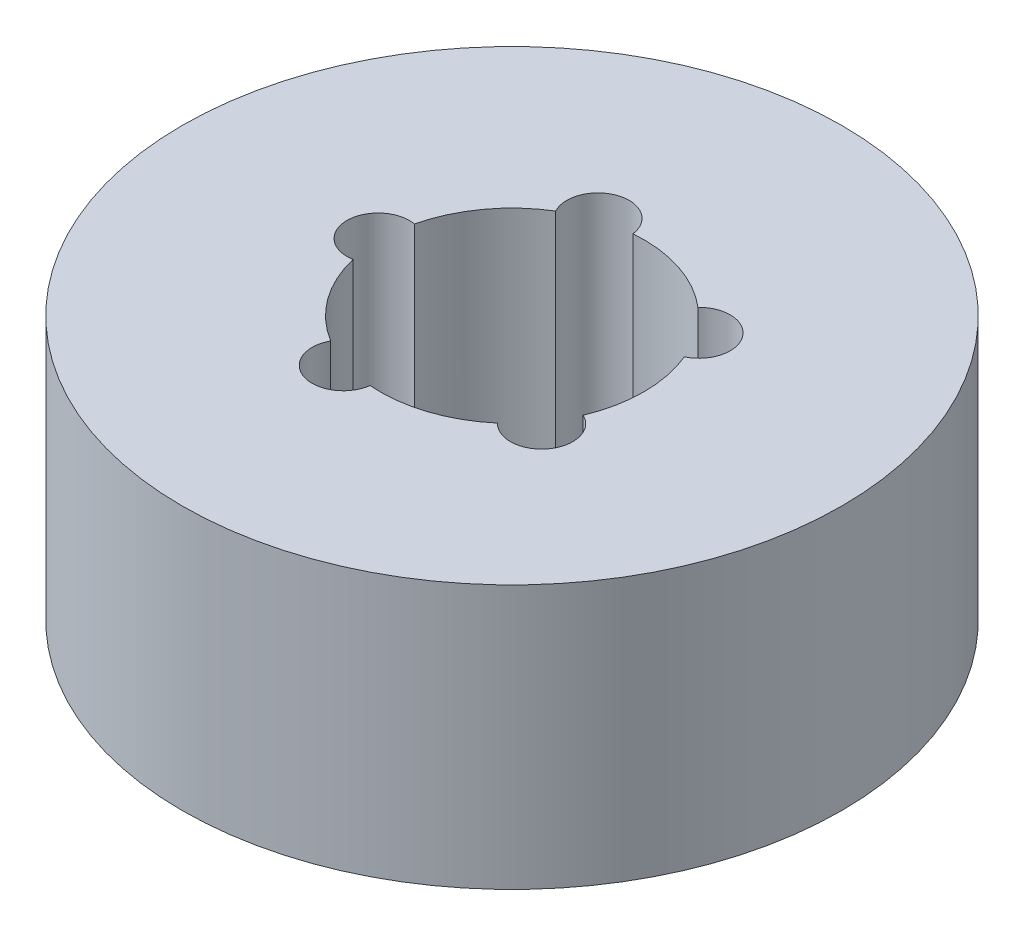
ISO-10303-21;
HEADER;
FILE_DESCRIPTION(('STEP AP214'),'2;1');
FILE_NAME('part.step','',(''),(''),'','','');
FILE_SCHEMA(('AUTOMOTIVE_DESIGN { 1 0 10303 214 1 1 1 1 }'));
ENDSEC;
DATA;
#1=APPLICATION_CONTEXT('core data for automotive mechanical design processes');
#2=APPLICATION_PROTOCOL_DEFINITION('international standard','automotive_design',2000,#1);
#3=PRODUCT_CONTEXT('',#1,'mechanical');
#4=PRODUCT('Part','Part','',(#3));
#5=PRODUCT_RELATED_PRODUCT_CATEGORY('part','',(#4));
#6=PRODUCT_DEFINITION_FORMATION('','',#4);
#7=PRODUCT_DEFINITION_CONTEXT('part definition',#1,'design');
#8=PRODUCT_DEFINITION('design','',#6,#7);
#9=PRODUCT_DEFINITION_SHAPE('','',#8);
#10=(LENGTH_UNIT() NAMED_UNIT(*) SI_UNIT(.MILLI.,.METRE.));
#11=(NAMED_UNIT(*) PLANE_ANGLE_UNIT() SI_UNIT($,.RADIAN.));
#12=(NAMED_UNIT(*) SI_UNIT($,.STERADIAN.) SOLID_ANGLE_UNIT());
#13=UNCERTAINTY_MEASURE_WITH_UNIT(LENGTH_MEASURE(1.E-05),#10,'distance_accuracy_value','');
#14=(GEOMETRIC_REPRESENTATION_CONTEXT(3) GLOBAL_UNCERTAINTY_ASSIGNED_CONTEXT((#13)) GLOBAL_UNIT_ASSIGNED_CONTEXT((#10,
#11,#12)) REPRESENTATION_CONTEXT('',''));
#15=CARTESIAN_POINT('',(0.,0.,0.));
#16=DIRECTION('',(0.,0.,1.));
#17=DIRECTION('',(1.,0.,0.));
#18=AXIS2_PLACEMENT_3D('',#15,#16,#17);
#19=CARTESIAN_POINT('',(0.,20.,0.));
#20=DIRECTION('',(0.,-1.,0.));
#21=DIRECTION('',(0.,0.,-1.));
#22=AXIS2_PLACEMENT_3D('',#19,#20,#21);
#23=CYLINDRICAL_SURFACE('',#22,25.);
#24=CARTESIAN_POINT('',(0.,20.,0.));
#25=DIRECTION('',(0.,1.,0.));
#26=DIRECTION('',(0.,0.,1.));
#27=AXIS2_PLACEMENT_3D('',#24,#25,#26);
#28=CIRCLE('',#27,25.);
#29=CARTESIAN_POINT('',(0.,20.,25.));
#30=VERTEX_POINT('',#29);
#31=EDGE_CURVE('E157',#30,#30,#28,.T.);
#32=ORIENTED_EDGE('',*,*,#31,.F.);
#33=EDGE_LOOP('',(#32));
#34=FACE_BOUND('',#33,.T.);
#35=CARTESIAN_POINT('',(0.,0.,0.));
#36=DIRECTION('',(0.,1.,0.));
#37=DIRECTION('',(0.,0.,1.));
#38=AXIS2_PLACEMENT_3D('',#35,#36,#37);
#39=CIRCLE('',#38,25.);
#40=CARTESIAN_POINT('',(0.,0.,25.));
#41=VERTEX_POINT('',#40);
#42=EDGE_CURVE('E150',#41,#41,#39,.T.);
#43=ORIENTED_EDGE('',*,*,#42,.T.);
#44=EDGE_LOOP('',(#43));
#45=FACE_BOUND('',#44,.T.);
#46=ADVANCED_FACE('F39',(#34,#45),#23,.T.);
#47=CARTESIAN_POINT('',(0.,20.,0.));
#48=DIRECTION('',(0.,1.,0.));
#49=DIRECTION('',(0.,0.,1.));
#50=AXIS2_PLACEMENT_3D('',#47,#48,#49);
#51=PLANE('',#50);
#52=CARTESIAN_POINT('',(-3.13641584657563,20.,-9.65289541674102));
#53=DIRECTION('',(0.,1.,0.));
#54=DIRECTION('',(-0.95105651629515,0.,0.309016994374958));
#55=AXIS2_PLACEMENT_3D('',#52,#53,#54);
#56=CIRCLE('',#55,2.3653306367673);
#57=CARTESIAN_POINT('',(-0.792244390742548,20.,-9.9685680428704));
#58=VERTEX_POINT('',#57);
#59=CARTESIAN_POINT('',(-5.21843810626451,20.,-8.53041052535495));
#60=VERTEX_POINT('',#59);
#61=EDGE_CURVE('E194',#58,#60,#56,.T.);
#62=ORIENTED_EDGE('',*,*,#61,.F.);
#63=CARTESIAN_POINT('',(0.,20.,0.));
#64=DIRECTION('',(0.,1.,0.));
#65=DIRECTION('',(0.,0.,1.));
#66=AXIS2_PLACEMENT_3D('',#63,#64,#65);
#67=CIRCLE('',#66,10.);
#68=CARTESIAN_POINT('',(6.50031645788205,20.,-7.59907138717539));
#69=VERTEX_POINT('',#68);
#70=EDGE_CURVE('E147',#69,#58,#67,.T.);
#71=ORIENTED_EDGE('',*,*,#70,.F.);
#72=CARTESIAN_POINT('',(8.21124328918843,20.,-5.96581745739413));
#73=DIRECTION('',(0.,1.,0.));
#74=DIRECTION('',(-0.58778525229248,0.,-0.809016994374942));
#75=AXIS2_PLACEMENT_3D('',#72,#73,#74);
#76=CIRCLE('',#75,2.3653306367673);
#77=CARTESIAN_POINT('',(9.23585461486585,20.,-3.83392612514392));
#78=VERTEX_POINT('',#77);
#79=EDGE_CURVE('E254',#78,#69,#76,.T.);
#80=ORIENTED_EDGE('',*,*,#79,.F.);
#81=CARTESIAN_POINT('',(9.23585461486591,20.,3.83392612514379));
#82=VERTEX_POINT('',#81);
#83=EDGE_CURVE('E144',#82,#78,#67,.T.);
#84=ORIENTED_EDGE('',*,*,#83,.F.);
#85=CARTESIAN_POINT('',(8.21124328918852,20.,5.96581745739401));
#86=DIRECTION('',(0.,1.,0.));
#87=DIRECTION('',(0.587785252292469,0.,-0.809016994374951));
#88=AXIS2_PLACEMENT_3D('',#85,#86,#87);
#89=CIRCLE('',#88,2.3653306367673);
#90=CARTESIAN_POINT('',(6.50031645788216,20.,7.59907138717529));
#91=VERTEX_POINT('',#90);
#92=EDGE_CURVE('E141',#91,#82,#89,.T.);
#93=ORIENTED_EDGE('',*,*,#92,.F.);
#94=CARTESIAN_POINT('',(-0.792244390742406,20.,9.96856804287041));
#95=VERTEX_POINT('',#94);
#96=EDGE_CURVE('E134',#95,#91,#67,.T.);
#97=ORIENTED_EDGE('',*,*,#96,.F.);
#98=CARTESIAN_POINT('',(-3.13641584657549,20.,9.65289541674107));
#99=DIRECTION('',(0.,1.,0.));
#100=DIRECTION('',(0.951056516295155,0.,0.309016994374945));
#101=AXIS2_PLACEMENT_3D('',#98,#99,#100);
#102=CIRCLE('',#101,2.3653306367673);
#103=CARTESIAN_POINT('',(-5.21843810626439,20.,8.53041052535502));
#104=VERTEX_POINT('',#103);
#105=EDGE_CURVE('E111',#104,#95,#102,.T.);
#106=ORIENTED_EDGE('',*,*,#105,.F.);
#107=CARTESIAN_POINT('',(-9.72548857574117,20.,2.32698774451609));
#108=VERTEX_POINT('',#107);
#109=EDGE_CURVE('E145',#108,#104,#67,.T.);
#110=ORIENTED_EDGE('',*,*,#109,.F.);
#111=CARTESIAN_POINT('',(-10.1496548852259,20.,0.));
#112=DIRECTION('',(0.,1.,0.));
#113=DIRECTION('',(0.,0.,1.));
#114=AXIS2_PLACEMENT_3D('',#111,#112,#113);
#115=CIRCLE('',#114,2.3653306367673);
#116=CARTESIAN_POINT('',(-9.72548857574117,20.,-2.32698774451609));
#117=VERTEX_POINT('',#116);
#118=EDGE_CURVE('E153',#117,#108,#115,.T.);
#119=ORIENTED_EDGE('',*,*,#118,.F.);
#120=EDGE_CURVE('E146',#60,#117,#67,.T.);
#121=ORIENTED_EDGE('',*,*,#120,.F.);
#122=EDGE_LOOP('',(#62,#71,#80,#84,#93,#97,#106,#110,#119,#121));
#123=FACE_BOUND('',#122,.T.);
#124=ORIENTED_EDGE('',*,*,#31,.T.);
#125=EDGE_LOOP('',(#124));
#126=FACE_BOUND('',#125,.T.);
#127=ADVANCED_FACE('F139',(#123,#126),#51,.T.);
#128=CARTESIAN_POINT('',(0.,0.,0.));
#129=DIRECTION('',(0.,1.,0.));
#130=DIRECTION('',(0.,0.,1.));
#131=AXIS2_PLACEMENT_3D('',#128,#129,#130);
#132=PLANE('',#131);
#133=CARTESIAN_POINT('',(0.,0.,0.));
#134=DIRECTION('',(0.,1.,0.));
#135=DIRECTION('',(0.,0.,1.));
#136=AXIS2_PLACEMENT_3D('',#133,#134,#135);
#137=CIRCLE('',#136,10.);
#138=CARTESIAN_POINT('',(0.,0.,10.));
#139=VERTEX_POINT('',#138);
#140=EDGE_CURVE('E154',#139,#139,#137,.T.);
#141=ORIENTED_EDGE('',*,*,#140,.T.);
#142=EDGE_LOOP('',(#141));
#143=FACE_BOUND('',#142,.T.);
#144=ORIENTED_EDGE('',*,*,#42,.F.);
#145=EDGE_LOOP('',(#144));
#146=FACE_BOUND('',#145,.T.);
#147=ADVANCED_FACE('F213',(#143,#146),#132,.F.);
#148=CARTESIAN_POINT('',(0.,20.,0.));
#149=DIRECTION('',(0.,-1.,0.));
#150=DIRECTION('',(0.,0.,-1.));
#151=AXIS2_PLACEMENT_3D('',#148,#149,#150);
#152=CYLINDRICAL_SURFACE('',#151,10.);
#153=DIRECTION('',(0.,1.,0.));
#154=VECTOR('',#153,1.);
#155=CARTESIAN_POINT('',(-0.792244390742548,11.6413522933733,-9.9685680428704));
#156=LINE('',#155,#154);
#157=CARTESIAN_POINT('',(-0.792244390742548,3.28270458674656,-9.9685680428704));
#158=VERTEX_POINT('',#157);
#159=EDGE_CURVE('E11',#158,#58,#156,.T.);
#160=ORIENTED_EDGE('',*,*,#159,.F.);
#161=CARTESIAN_POINT('',(0.,3.28270458674656,0.));
#162=DIRECTION('',(0.,1.,0.));
#163=DIRECTION('',(0.,0.,1.));
#164=AXIS2_PLACEMENT_3D('',#161,#162,#163);
#165=CIRCLE('',#164,10.);
#166=CARTESIAN_POINT('',(-5.21843810626451,3.28270458674656,-8.53041052535495));
#167=VERTEX_POINT('',#166);
#168=EDGE_CURVE('E189',#158,#167,#165,.T.);
#169=ORIENTED_EDGE('',*,*,#168,.T.);
#170=DIRECTION('',(0.,1.,0.));
#171=VECTOR('',#170,1.);
#172=CARTESIAN_POINT('',(-5.21843810626451,11.6413522933733,-8.53041052535495));
#173=LINE('',#172,#171);
#174=EDGE_CURVE('E46',#60,#167,#173,.F.);
#175=ORIENTED_EDGE('',*,*,#174,.F.);
#176=ORIENTED_EDGE('',*,*,#120,.T.);
#177=DIRECTION('',(0.,1.,0.));
#178=VECTOR('',#177,1.);
#179=CARTESIAN_POINT('',(-9.72548857574117,11.6413522933733,-2.32698774451609));
#180=LINE('',#179,#178);
#181=CARTESIAN_POINT('',(-9.72548857574117,3.28270458674656,-2.32698774451609));
#182=VERTEX_POINT('',#181);
#183=EDGE_CURVE('E168',#182,#117,#180,.T.);
#184=ORIENTED_EDGE('',*,*,#183,.F.);
#185=CARTESIAN_POINT('',(0.,3.28270458674656,0.));
#186=DIRECTION('',(0.,1.,0.));
#187=DIRECTION('',(0.,0.,1.));
#188=AXIS2_PLACEMENT_3D('',#185,#186,#187);
#189=CIRCLE('',#188,10.);
#190=CARTESIAN_POINT('',(-9.72548857574117,3.28270458674656,2.32698774451609));
#191=VERTEX_POINT('',#190);
#192=EDGE_CURVE('E165',#182,#191,#189,.T.);
#193=ORIENTED_EDGE('',*,*,#192,.T.);
#194=DIRECTION('',(0.,1.,0.));
#195=VECTOR('',#194,1.);
#196=CARTESIAN_POINT('',(-9.72548857574117,11.6413522933733,2.32698774451609));
#197=LINE('',#196,#195);
#198=EDGE_CURVE('E170',#108,#191,#197,.F.);
#199=ORIENTED_EDGE('',*,*,#198,.F.);
#200=ORIENTED_EDGE('',*,*,#109,.T.);
#201=DIRECTION('',(0.,1.,0.));
#202=VECTOR('',#201,1.);
#203=CARTESIAN_POINT('',(-5.21843810626439,11.6413522933733,8.53041052535502));
#204=LINE('',#203,#202);
#205=CARTESIAN_POINT('',(-5.21843810626439,3.28270458674656,8.53041052535502));
#206=VERTEX_POINT('',#205);
#207=EDGE_CURVE('E121',#206,#104,#204,.T.);
#208=ORIENTED_EDGE('',*,*,#207,.F.);
#209=CARTESIAN_POINT('',(0.,3.28270458674656,0.));
#210=DIRECTION('',(0.,1.,0.));
#211=DIRECTION('',(0.,0.,1.));
#212=AXIS2_PLACEMENT_3D('',#209,#210,#211);
#213=CIRCLE('',#212,10.);
#214=CARTESIAN_POINT('',(-0.792244390742406,3.28270458674656,9.96856804287041));
#215=VERTEX_POINT('',#214);
#216=EDGE_CURVE('E136',#206,#215,#213,.T.);
#217=ORIENTED_EDGE('',*,*,#216,.T.);
#218=DIRECTION('',(0.,1.,0.));
#219=VECTOR('',#218,1.);
#220=CARTESIAN_POINT('',(-0.792244390742406,11.6413522933733,9.96856804287041));
#221=LINE('',#220,#219);
#222=EDGE_CURVE('E117',#95,#215,#221,.F.);
#223=ORIENTED_EDGE('',*,*,#222,.F.);
#224=ORIENTED_EDGE('',*,*,#96,.T.);
#225=DIRECTION('',(0.,1.,0.));
#226=VECTOR('',#225,1.);
#227=CARTESIAN_POINT('',(6.50031645788217,11.6413522933733,7.59907138717529));
#228=LINE('',#227,#226);
#229=CARTESIAN_POINT('',(6.50031645788216,3.28270458674656,7.59907138717529));
#230=VERTEX_POINT('',#229);
#231=EDGE_CURVE('E182',#230,#91,#228,.T.);
#232=ORIENTED_EDGE('',*,*,#231,.F.);
#233=CARTESIAN_POINT('',(0.,3.28270458674656,0.));
#234=DIRECTION('',(0.,1.,0.));
#235=DIRECTION('',(0.,0.,1.));
#236=AXIS2_PLACEMENT_3D('',#233,#234,#235);
#237=CIRCLE('',#236,10.);
#238=CARTESIAN_POINT('',(9.23585461486591,3.28270458674656,3.83392612514379));
#239=VERTEX_POINT('',#238);
#240=EDGE_CURVE('E174',#230,#239,#237,.T.);
#241=ORIENTED_EDGE('',*,*,#240,.T.);
#242=DIRECTION('',(0.,1.,0.));
#243=VECTOR('',#242,1.);
#244=CARTESIAN_POINT('',(9.23585461486591,11.6413522933733,3.83392612514379));
#245=LINE('',#244,#243);
#246=EDGE_CURVE('E177',#82,#239,#245,.F.);
#247=ORIENTED_EDGE('',*,*,#246,.F.);
#248=ORIENTED_EDGE('',*,*,#83,.T.);
#249=DIRECTION('',(0.,1.,0.));
#250=VECTOR('',#249,1.);
#251=CARTESIAN_POINT('',(9.23585461486585,11.6413522933733,-3.83392612514392));
#252=LINE('',#251,#250);
#253=CARTESIAN_POINT('',(9.23585461486585,3.28270458674656,-3.83392612514392));
#254=VERTEX_POINT('',#253);
#255=EDGE_CURVE('E187',#254,#78,#252,.T.);
#256=ORIENTED_EDGE('',*,*,#255,.F.);
#257=CARTESIAN_POINT('',(0.,3.28270458674656,0.));
#258=DIRECTION('',(0.,1.,0.));
#259=DIRECTION('',(0.,0.,1.));
#260=AXIS2_PLACEMENT_3D('',#257,#258,#259);
#261=CIRCLE('',#260,10.);
#262=CARTESIAN_POINT('',(6.50031645788205,3.28270458674656,-7.59907138717539));
#263=VERTEX_POINT('',#262);
#264=EDGE_CURVE('E181',#254,#263,#261,.T.);
#265=ORIENTED_EDGE('',*,*,#264,.T.);
#266=DIRECTION('',(0.,1.,0.));
#267=VECTOR('',#266,1.);
#268=CARTESIAN_POINT('',(6.50031645788206,11.6413522933733,-7.59907138717539));
#269=LINE('',#268,#267);
#270=EDGE_CURVE('E186',#69,#263,#269,.F.);
#271=ORIENTED_EDGE('',*,*,#270,.F.);
#272=ORIENTED_EDGE('',*,*,#70,.T.);
#273=EDGE_LOOP('',(#160,#169,#175,#176,#184,#193,#199,#200,#208,#217,#223,#224,#232,#241,#247,
#248,#256,#265,#271,#272));
#274=FACE_BOUND('',#273,.T.);
#275=ORIENTED_EDGE('',*,*,#140,.F.);
#276=EDGE_LOOP('',(#275));
#277=FACE_BOUND('',#276,.T.);
#278=ADVANCED_FACE('F135',(#274,#277),#152,.F.);
#279=CARTESIAN_POINT('',(-10.1496548852259,3.28270458674656,0.));
#280=DIRECTION('',(0.,1.,0.));
#281=DIRECTION('',(0.,0.,1.));
#282=AXIS2_PLACEMENT_3D('',#279,#280,#281);
#283=CYLINDRICAL_SURFACE('',#282,2.3653306367673);
#284=ORIENTED_EDGE('',*,*,#183,.T.);
#285=ORIENTED_EDGE('',*,*,#118,.T.);
#286=ORIENTED_EDGE('',*,*,#198,.T.);
#287=CARTESIAN_POINT('',(-10.1496548852259,3.28270458674656,0.));
#288=DIRECTION('',(0.,1.,0.));
#289=DIRECTION('',(0.,0.,1.));
#290=AXIS2_PLACEMENT_3D('',#287,#288,#289);
#291=CIRCLE('',#290,2.3653306367673);
#292=EDGE_CURVE('E158',#182,#191,#291,.T.);
#293=ORIENTED_EDGE('',*,*,#292,.F.);
#294=EDGE_LOOP('',(#284,#285,#286,#293));
#295=FACE_BOUND('',#294,.T.);
#296=ADVANCED_FACE('F221',(#295),#283,.F.);
#297=CARTESIAN_POINT('',(-10.1496548852259,3.28270458674656,0.));
#298=DIRECTION('',(0.,1.,0.));
#299=DIRECTION('',(0.,0.,1.));
#300=AXIS2_PLACEMENT_3D('',#297,#298,#299);
#301=PLANE('',#300);
#302=ORIENTED_EDGE('',*,*,#292,.T.);
#303=ORIENTED_EDGE('',*,*,#192,.F.);
#304=EDGE_LOOP('',(#302,#303));
#305=FACE_BOUND('',#304,.T.);
#306=ADVANCED_FACE('F227',(#305),#301,.T.);
#307=CARTESIAN_POINT('',(-3.13641584657549,3.28270458674656,9.65289541674107));
#308=DIRECTION('',(0.,1.,0.));
#309=DIRECTION('',(0.,0.,1.));
#310=AXIS2_PLACEMENT_3D('',#307,#308,#309);
#311=CYLINDRICAL_SURFACE('',#310,2.3653306367673);
#312=ORIENTED_EDGE('',*,*,#207,.T.);
#313=ORIENTED_EDGE('',*,*,#105,.T.);
#314=ORIENTED_EDGE('',*,*,#222,.T.);
#315=CARTESIAN_POINT('',(-3.13641584657549,3.28270458674656,9.65289541674107));
#316=DIRECTION('',(0.,1.,0.));
#317=DIRECTION('',(0.951056516295155,0.,0.309016994374945));
#318=AXIS2_PLACEMENT_3D('',#315,#316,#317);
#319=CIRCLE('',#318,2.3653306367673);
#320=EDGE_CURVE('E127',#206,#215,#319,.T.);
#321=ORIENTED_EDGE('',*,*,#320,.F.);
#322=EDGE_LOOP('',(#312,#313,#314,#321));
#323=FACE_BOUND('',#322,.T.);
#324=ADVANCED_FACE('F116',(#323),#311,.F.);
#325=CARTESIAN_POINT('',(-3.13641584657549,3.28270458674656,9.65289541674107));
#326=DIRECTION('',(0.,1.,0.));
#327=DIRECTION('',(0.951056516295155,0.,0.309016994374945));
#328=AXIS2_PLACEMENT_3D('',#325,#326,#327);
#329=PLANE('',#328);
#330=ORIENTED_EDGE('',*,*,#320,.T.);
#331=ORIENTED_EDGE('',*,*,#216,.F.);
#332=EDGE_LOOP('',(#330,#331));
#333=FACE_BOUND('',#332,.T.);
#334=ADVANCED_FACE('F234',(#333),#329,.T.);
#335=CARTESIAN_POINT('',(8.21124328918852,3.28270458674656,5.96581745739401));
#336=DIRECTION('',(0.,1.,0.));
#337=DIRECTION('',(0.,0.,1.));
#338=AXIS2_PLACEMENT_3D('',#335,#336,#337);
#339=CYLINDRICAL_SURFACE('',#338,2.3653306367673);
#340=ORIENTED_EDGE('',*,*,#231,.T.);
#341=ORIENTED_EDGE('',*,*,#92,.T.);
#342=ORIENTED_EDGE('',*,*,#246,.T.);
#343=CARTESIAN_POINT('',(8.21124328918852,3.28270458674656,5.96581745739401));
#344=DIRECTION('',(0.,1.,0.));
#345=DIRECTION('',(0.587785252292469,0.,-0.809016994374951));
#346=AXIS2_PLACEMENT_3D('',#343,#344,#345);
#347=CIRCLE('',#346,2.3653306367673);
#348=EDGE_CURVE('E130',#230,#239,#347,.T.);
#349=ORIENTED_EDGE('',*,*,#348,.F.);
#350=EDGE_LOOP('',(#340,#341,#342,#349));
#351=FACE_BOUND('',#350,.T.);
#352=ADVANCED_FACE('F240',(#351),#339,.F.);
#353=CARTESIAN_POINT('',(8.21124328918852,3.28270458674656,5.96581745739401));
#354=DIRECTION('',(0.,1.,0.));
#355=DIRECTION('',(0.587785252292469,0.,-0.809016994374951));
#356=AXIS2_PLACEMENT_3D('',#353,#354,#355);
#357=PLANE('',#356);
#358=ORIENTED_EDGE('',*,*,#348,.T.);
#359=ORIENTED_EDGE('',*,*,#240,.F.);
#360=EDGE_LOOP('',(#358,#359));
#361=FACE_BOUND('',#360,.T.);
#362=ADVANCED_FACE('F245',(#361),#357,.T.);
#363=CARTESIAN_POINT('',(8.21124328918843,3.28270458674656,-5.96581745739413));
#364=DIRECTION('',(0.,1.,0.));
#365=DIRECTION('',(0.,0.,1.));
#366=AXIS2_PLACEMENT_3D('',#363,#364,#365);
#367=CYLINDRICAL_SURFACE('',#366,2.3653306367673);
#368=ORIENTED_EDGE('',*,*,#255,.T.);
#369=ORIENTED_EDGE('',*,*,#79,.T.);
#370=ORIENTED_EDGE('',*,*,#270,.T.);
#371=CARTESIAN_POINT('',(8.21124328918843,3.28270458674656,-5.96581745739413));
#372=DIRECTION('',(0.,1.,0.));
#373=DIRECTION('',(-0.58778525229248,0.,-0.809016994374942));
#374=AXIS2_PLACEMENT_3D('',#371,#372,#373);
#375=CIRCLE('',#374,2.3653306367673);
#376=EDGE_CURVE('E56',#254,#263,#375,.T.);
#377=ORIENTED_EDGE('',*,*,#376,.F.);
#378=EDGE_LOOP('',(#368,#369,#370,#377));
#379=FACE_BOUND('',#378,.T.);
#380=ADVANCED_FACE('F266',(#379),#367,.F.);
#381=CARTESIAN_POINT('',(8.21124328918843,3.28270458674656,-5.96581745739413));
#382=DIRECTION('',(0.,1.,0.));
#383=DIRECTION('',(-0.58778525229248,0.,-0.809016994374942));
#384=AXIS2_PLACEMENT_3D('',#381,#382,#383);
#385=PLANE('',#384);
#386=ORIENTED_EDGE('',*,*,#376,.T.);
#387=ORIENTED_EDGE('',*,*,#264,.F.);
#388=EDGE_LOOP('',(#386,#387));
#389=FACE_BOUND('',#388,.T.);
#390=ADVANCED_FACE('F204',(#389),#385,.T.);
#391=CARTESIAN_POINT('',(-3.13641584657563,3.28270458674656,-9.65289541674102));
#392=DIRECTION('',(0.,1.,0.));
#393=DIRECTION('',(0.,0.,1.));
#394=AXIS2_PLACEMENT_3D('',#391,#392,#393);
#395=CYLINDRICAL_SURFACE('',#394,2.3653306367673);
#396=ORIENTED_EDGE('',*,*,#159,.T.);
#397=ORIENTED_EDGE('',*,*,#61,.T.);
#398=ORIENTED_EDGE('',*,*,#174,.T.);
#399=CARTESIAN_POINT('',(-3.13641584657563,3.28270458674656,-9.65289541674102));
#400=DIRECTION('',(0.,1.,0.));
#401=DIRECTION('',(-0.95105651629515,0.,0.309016994374958));
#402=AXIS2_PLACEMENT_3D('',#399,#400,#401);
#403=CIRCLE('',#402,2.3653306367673);
#404=EDGE_CURVE('E55',#158,#167,#403,.T.);
#405=ORIENTED_EDGE('',*,*,#404,.F.);
#406=EDGE_LOOP('',(#396,#397,#398,#405));
#407=FACE_BOUND('',#406,.T.);
#408=ADVANCED_FACE('F193',(#407),#395,.F.);
#409=CARTESIAN_POINT('',(-3.13641584657563,3.28270458674656,-9.65289541674102));
#410=DIRECTION('',(0.,1.,0.));
#411=DIRECTION('',(-0.95105651629515,0.,0.309016994374958));
#412=AXIS2_PLACEMENT_3D('',#409,#410,#411);
#413=PLANE('',#412);
#414=ORIENTED_EDGE('',*,*,#404,.T.);
#415=ORIENTED_EDGE('',*,*,#168,.F.);
#416=EDGE_LOOP('',(#414,#415));
#417=FACE_BOUND('',#416,.T.);
#418=ADVANCED_FACE('F196',(#417),#413,.T.);
#419=CLOSED_SHELL('',(#46,#127,#147,#278,#296,#306,#324,#334,#352,#362,#380,#390,#408,#418));
#420=MANIFOLD_SOLID_BREP('B2',#419);
#421=ADVANCED_BREP_SHAPE_REPRESENTATION('',(#18,#420),#14);
#422=SHAPE_DEFINITION_REPRESENTATION(#9,#421);
ENDSEC;
END-ISO-10303-21;
